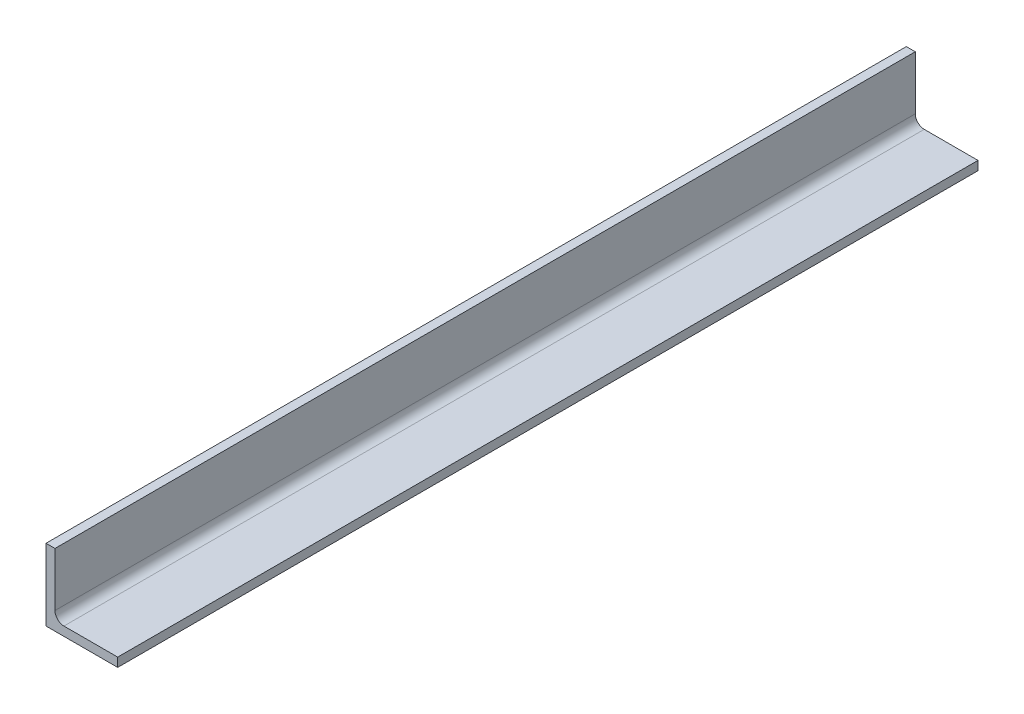
ISO-10303-21;
HEADER;
FILE_DESCRIPTION(('STEP AP214'),'2;1');
FILE_NAME('part.step','',(''),(''),'','','');
FILE_SCHEMA(('AUTOMOTIVE_DESIGN { 1 0 10303 214 1 1 1 1 }'));
ENDSEC;
DATA;
#1=APPLICATION_CONTEXT('core data for automotive mechanical design processes');
#2=APPLICATION_PROTOCOL_DEFINITION('international standard','automotive_design',2000,#1);
#3=PRODUCT_CONTEXT('',#1,'mechanical');
#4=PRODUCT('Part','Part','',(#3));
#5=PRODUCT_RELATED_PRODUCT_CATEGORY('part','',(#4));
#6=PRODUCT_DEFINITION_FORMATION('','',#4);
#7=PRODUCT_DEFINITION_CONTEXT('part definition',#1,'design');
#8=PRODUCT_DEFINITION('design','',#6,#7);
#9=PRODUCT_DEFINITION_SHAPE('','',#8);
#10=(LENGTH_UNIT() NAMED_UNIT(*) SI_UNIT(.MILLI.,.METRE.));
#11=(NAMED_UNIT(*) PLANE_ANGLE_UNIT() SI_UNIT($,.RADIAN.));
#12=(NAMED_UNIT(*) SI_UNIT($,.STERADIAN.) SOLID_ANGLE_UNIT());
#13=UNCERTAINTY_MEASURE_WITH_UNIT(LENGTH_MEASURE(1.E-05),#10,'distance_accuracy_value','');
#14=(GEOMETRIC_REPRESENTATION_CONTEXT(3) GLOBAL_UNCERTAINTY_ASSIGNED_CONTEXT((#13)) GLOBAL_UNIT_ASSIGNED_CONTEXT((#10,
#11,#12)) REPRESENTATION_CONTEXT('',''));
#15=CARTESIAN_POINT('',(0.,0.,0.));
#16=DIRECTION('',(0.,0.,1.));
#17=DIRECTION('',(1.,0.,0.));
#18=AXIS2_PLACEMENT_3D('',#15,#16,#17);
#19=CARTESIAN_POINT('',(50.8,0.,304.8));
#20=DIRECTION('',(0.,1.,0.));
#21=DIRECTION('',(-1.,0.,0.));
#22=AXIS2_PLACEMENT_3D('',#19,#20,#21);
#23=PLANE('',#22);
#24=DIRECTION('',(1.,0.,0.));
#25=VECTOR('',#24,1.);
#26=CARTESIAN_POINT('',(50.8,0.,-304.8));
#27=LINE('',#26,#25);
#28=CARTESIAN_POINT('',(0.,0.,-304.8));
#29=VERTEX_POINT('',#28);
#30=CARTESIAN_POINT('',(50.8,0.,-304.8));
#31=VERTEX_POINT('',#30);
#32=EDGE_CURVE('E125',#29,#31,#27,.T.);
#33=ORIENTED_EDGE('',*,*,#32,.T.);
#34=DIRECTION('',(0.,0.,-1.));
#35=VECTOR('',#34,1.);
#36=CARTESIAN_POINT('',(50.8,0.,304.8));
#37=LINE('',#36,#35);
#38=CARTESIAN_POINT('',(50.8,0.,304.8));
#39=VERTEX_POINT('',#38);
#40=EDGE_CURVE('E11',#39,#31,#37,.T.);
#41=ORIENTED_EDGE('',*,*,#40,.F.);
#42=DIRECTION('',(1.,0.,0.));
#43=VECTOR('',#42,1.);
#44=CARTESIAN_POINT('',(50.8,0.,304.8));
#45=LINE('',#44,#43);
#46=CARTESIAN_POINT('',(0.,0.,304.8));
#47=VERTEX_POINT('',#46);
#48=EDGE_CURVE('E137',#47,#39,#45,.T.);
#49=ORIENTED_EDGE('',*,*,#48,.F.);
#50=DIRECTION('',(0.,0.,-1.));
#51=VECTOR('',#50,1.);
#52=CARTESIAN_POINT('',(0.,0.,304.8));
#53=LINE('',#52,#51);
#54=EDGE_CURVE('E121',#47,#29,#53,.T.);
#55=ORIENTED_EDGE('',*,*,#54,.T.);
#56=EDGE_LOOP('',(#33,#41,#49,#55));
#57=FACE_BOUND('',#56,.T.);
#58=ADVANCED_FACE('F35',(#57),#23,.F.);
#59=CARTESIAN_POINT('',(50.8,6.35000000000001,304.8));
#60=DIRECTION('',(-1.,0.,0.));
#61=DIRECTION('',(0.,0.,1.));
#62=AXIS2_PLACEMENT_3D('',#59,#60,#61);
#63=PLANE('',#62);
#64=DIRECTION('',(0.,1.,0.));
#65=VECTOR('',#64,1.);
#66=CARTESIAN_POINT('',(50.8,6.35000000000001,-304.8));
#67=LINE('',#66,#65);
#68=CARTESIAN_POINT('',(50.8,6.35000000000001,-304.8));
#69=VERTEX_POINT('',#68);
#70=EDGE_CURVE('E128',#31,#69,#67,.T.);
#71=ORIENTED_EDGE('',*,*,#70,.T.);
#72=DIRECTION('',(0.,0.,-1.));
#73=VECTOR('',#72,1.);
#74=CARTESIAN_POINT('',(50.8,6.35000000000001,304.8));
#75=LINE('',#74,#73);
#76=CARTESIAN_POINT('',(50.8,6.35000000000001,304.8));
#77=VERTEX_POINT('',#76);
#78=EDGE_CURVE('E43',#77,#69,#75,.T.);
#79=ORIENTED_EDGE('',*,*,#78,.F.);
#80=DIRECTION('',(0.,1.,0.));
#81=VECTOR('',#80,1.);
#82=CARTESIAN_POINT('',(50.8,6.35000000000001,304.8));
#83=LINE('',#82,#81);
#84=EDGE_CURVE('E91',#39,#77,#83,.T.);
#85=ORIENTED_EDGE('',*,*,#84,.F.);
#86=ORIENTED_EDGE('',*,*,#40,.T.);
#87=EDGE_LOOP('',(#71,#79,#85,#86));
#88=FACE_BOUND('',#87,.T.);
#89=ADVANCED_FACE('F162',(#88),#63,.F.);
#90=CARTESIAN_POINT('',(12.7,6.35000000000001,304.8));
#91=DIRECTION('',(0.,-1.,0.));
#92=DIRECTION('',(0.,0.,-1.));
#93=AXIS2_PLACEMENT_3D('',#90,#91,#92);
#94=PLANE('',#93);
#95=DIRECTION('',(-1.,0.,0.));
#96=VECTOR('',#95,1.);
#97=CARTESIAN_POINT('',(12.7,6.35000000000001,-304.8));
#98=LINE('',#97,#96);
#99=CARTESIAN_POINT('',(12.7,6.35000000000001,-304.8));
#100=VERTEX_POINT('',#99);
#101=EDGE_CURVE('E130',#69,#100,#98,.T.);
#102=ORIENTED_EDGE('',*,*,#101,.T.);
#103=DIRECTION('',(0.,0.,-1.));
#104=VECTOR('',#103,1.);
#105=CARTESIAN_POINT('',(12.7,6.35000000000001,304.8));
#106=LINE('',#105,#104);
#107=CARTESIAN_POINT('',(12.7,6.35000000000001,304.8));
#108=VERTEX_POINT('',#107);
#109=EDGE_CURVE('E141',#108,#100,#106,.T.);
#110=ORIENTED_EDGE('',*,*,#109,.F.);
#111=DIRECTION('',(-1.,0.,0.));
#112=VECTOR('',#111,1.);
#113=CARTESIAN_POINT('',(12.7,6.35000000000001,304.8));
#114=LINE('',#113,#112);
#115=EDGE_CURVE('E149',#77,#108,#114,.T.);
#116=ORIENTED_EDGE('',*,*,#115,.F.);
#117=ORIENTED_EDGE('',*,*,#78,.T.);
#118=EDGE_LOOP('',(#102,#110,#116,#117));
#119=FACE_BOUND('',#118,.T.);
#120=ADVANCED_FACE('F147',(#119),#94,.F.);
#121=CARTESIAN_POINT('',(12.7,12.7,304.8));
#122=DIRECTION('',(0.,0.,-1.));
#123=DIRECTION('',(-1.,0.,0.));
#124=AXIS2_PLACEMENT_3D('',#121,#122,#123);
#125=CYLINDRICAL_SURFACE('',#124,6.35);
#126=CARTESIAN_POINT('',(12.7,12.7,-304.8));
#127=DIRECTION('',(0.,0.,-1.));
#128=DIRECTION('',(-1.,0.,0.));
#129=AXIS2_PLACEMENT_3D('',#126,#127,#128);
#130=CIRCLE('',#129,6.35);
#131=CARTESIAN_POINT('',(6.35,12.7,-304.8));
#132=VERTEX_POINT('',#131);
#133=EDGE_CURVE('E132',#100,#132,#130,.T.);
#134=ORIENTED_EDGE('',*,*,#133,.T.);
#135=DIRECTION('',(0.,0.,-1.));
#136=VECTOR('',#135,1.);
#137=CARTESIAN_POINT('',(6.35,12.7,304.8));
#138=LINE('',#137,#136);
#139=CARTESIAN_POINT('',(6.35,12.7,304.8));
#140=VERTEX_POINT('',#139);
#141=EDGE_CURVE('E116',#140,#132,#138,.T.);
#142=ORIENTED_EDGE('',*,*,#141,.F.);
#143=CARTESIAN_POINT('',(12.7,12.7,304.8));
#144=DIRECTION('',(0.,0.,-1.));
#145=DIRECTION('',(-1.,0.,0.));
#146=AXIS2_PLACEMENT_3D('',#143,#144,#145);
#147=CIRCLE('',#146,6.35);
#148=EDGE_CURVE('E107',#108,#140,#147,.T.);
#149=ORIENTED_EDGE('',*,*,#148,.F.);
#150=ORIENTED_EDGE('',*,*,#109,.T.);
#151=EDGE_LOOP('',(#134,#142,#149,#150));
#152=FACE_BOUND('',#151,.T.);
#153=ADVANCED_FACE('F155',(#152),#125,.F.);
#154=CARTESIAN_POINT('',(6.35,50.8,304.8));
#155=DIRECTION('',(-1.,0.,0.));
#156=DIRECTION('',(0.,-1.,0.));
#157=AXIS2_PLACEMENT_3D('',#154,#155,#156);
#158=PLANE('',#157);
#159=DIRECTION('',(0.,1.,0.));
#160=VECTOR('',#159,1.);
#161=CARTESIAN_POINT('',(6.35,50.8,-304.8));
#162=LINE('',#161,#160);
#163=CARTESIAN_POINT('',(6.35,50.8,-304.8));
#164=VERTEX_POINT('',#163);
#165=EDGE_CURVE('E115',#132,#164,#162,.T.);
#166=ORIENTED_EDGE('',*,*,#165,.T.);
#167=DIRECTION('',(0.,0.,-1.));
#168=VECTOR('',#167,1.);
#169=CARTESIAN_POINT('',(6.35,50.8,304.8));
#170=LINE('',#169,#168);
#171=CARTESIAN_POINT('',(6.35,50.8,304.8));
#172=VERTEX_POINT('',#171);
#173=EDGE_CURVE('E112',#172,#164,#170,.T.);
#174=ORIENTED_EDGE('',*,*,#173,.F.);
#175=DIRECTION('',(0.,1.,0.));
#176=VECTOR('',#175,1.);
#177=CARTESIAN_POINT('',(6.35,50.8,304.8));
#178=LINE('',#177,#176);
#179=EDGE_CURVE('E101',#140,#172,#178,.T.);
#180=ORIENTED_EDGE('',*,*,#179,.F.);
#181=ORIENTED_EDGE('',*,*,#141,.T.);
#182=EDGE_LOOP('',(#166,#174,#180,#181));
#183=FACE_BOUND('',#182,.T.);
#184=ADVANCED_FACE('F113',(#183),#158,.F.);
#185=CARTESIAN_POINT('',(0.,50.8,304.8));
#186=DIRECTION('',(0.,-1.,0.));
#187=DIRECTION('',(0.,0.,-1.));
#188=AXIS2_PLACEMENT_3D('',#185,#186,#187);
#189=PLANE('',#188);
#190=DIRECTION('',(-1.,0.,0.));
#191=VECTOR('',#190,1.);
#192=CARTESIAN_POINT('',(0.,50.8,-304.8));
#193=LINE('',#192,#191);
#194=CARTESIAN_POINT('',(0.,50.8,-304.8));
#195=VERTEX_POINT('',#194);
#196=EDGE_CURVE('E77',#164,#195,#193,.T.);
#197=ORIENTED_EDGE('',*,*,#196,.T.);
#198=DIRECTION('',(0.,0.,-1.));
#199=VECTOR('',#198,1.);
#200=CARTESIAN_POINT('',(0.,50.8,304.8));
#201=LINE('',#200,#199);
#202=CARTESIAN_POINT('',(0.,50.8,304.8));
#203=VERTEX_POINT('',#202);
#204=EDGE_CURVE('E117',#203,#195,#201,.T.);
#205=ORIENTED_EDGE('',*,*,#204,.F.);
#206=DIRECTION('',(-1.,0.,0.));
#207=VECTOR('',#206,1.);
#208=CARTESIAN_POINT('',(0.,50.8,304.8));
#209=LINE('',#208,#207);
#210=EDGE_CURVE('E105',#172,#203,#209,.T.);
#211=ORIENTED_EDGE('',*,*,#210,.F.);
#212=ORIENTED_EDGE('',*,*,#173,.T.);
#213=EDGE_LOOP('',(#197,#205,#211,#212));
#214=FACE_BOUND('',#213,.T.);
#215=ADVANCED_FACE('F119',(#214),#189,.F.);
#216=CARTESIAN_POINT('',(0.,0.,304.8));
#217=DIRECTION('',(1.,0.,0.));
#218=DIRECTION('',(0.,0.,-1.));
#219=AXIS2_PLACEMENT_3D('',#216,#217,#218);
#220=PLANE('',#219);
#221=DIRECTION('',(0.,-1.,0.));
#222=VECTOR('',#221,1.);
#223=CARTESIAN_POINT('',(0.,0.,-304.8));
#224=LINE('',#223,#222);
#225=EDGE_CURVE('E83',#195,#29,#224,.T.);
#226=ORIENTED_EDGE('',*,*,#225,.T.);
#227=ORIENTED_EDGE('',*,*,#54,.F.);
#228=DIRECTION('',(0.,-1.,0.));
#229=VECTOR('',#228,1.);
#230=CARTESIAN_POINT('',(0.,0.,304.8));
#231=LINE('',#230,#229);
#232=EDGE_CURVE('E51',#203,#47,#231,.T.);
#233=ORIENTED_EDGE('',*,*,#232,.F.);
#234=ORIENTED_EDGE('',*,*,#204,.T.);
#235=EDGE_LOOP('',(#226,#227,#233,#234));
#236=FACE_BOUND('',#235,.T.);
#237=ADVANCED_FACE('F176',(#236),#220,.F.);
#238=CARTESIAN_POINT('',(12.7,12.7,304.8));
#239=DIRECTION('',(0.,0.,-1.));
#240=DIRECTION('',(-1.,0.,0.));
#241=AXIS2_PLACEMENT_3D('',#238,#239,#240);
#242=PLANE('',#241);
#243=ORIENTED_EDGE('',*,*,#48,.T.);
#244=ORIENTED_EDGE('',*,*,#84,.T.);
#245=ORIENTED_EDGE('',*,*,#115,.T.);
#246=ORIENTED_EDGE('',*,*,#148,.T.);
#247=ORIENTED_EDGE('',*,*,#179,.T.);
#248=ORIENTED_EDGE('',*,*,#210,.T.);
#249=ORIENTED_EDGE('',*,*,#232,.T.);
#250=EDGE_LOOP('',(#243,#244,#245,#246,#247,#248,#249));
#251=FACE_BOUND('',#250,.T.);
#252=ADVANCED_FACE('F103',(#251),#242,.F.);
#253=CARTESIAN_POINT('',(12.7,12.7,-304.8));
#254=DIRECTION('',(0.,0.,-1.));
#255=DIRECTION('',(-1.,0.,0.));
#256=AXIS2_PLACEMENT_3D('',#253,#254,#255);
#257=PLANE('',#256);
#258=ORIENTED_EDGE('',*,*,#32,.F.);
#259=ORIENTED_EDGE('',*,*,#225,.F.);
#260=ORIENTED_EDGE('',*,*,#196,.F.);
#261=ORIENTED_EDGE('',*,*,#165,.F.);
#262=ORIENTED_EDGE('',*,*,#133,.F.);
#263=ORIENTED_EDGE('',*,*,#101,.F.);
#264=ORIENTED_EDGE('',*,*,#70,.F.);
#265=EDGE_LOOP('',(#258,#259,#260,#261,#262,#263,#264));
#266=FACE_BOUND('',#265,.T.);
#267=ADVANCED_FACE('F153',(#266),#257,.T.);
#268=CLOSED_SHELL('',(#58,#89,#120,#153,#184,#215,#237,#252,#267));
#269=MANIFOLD_SOLID_BREP('B2',#268);
#270=ADVANCED_BREP_SHAPE_REPRESENTATION('',(#18,#269),#14);
#271=SHAPE_DEFINITION_REPRESENTATION(#9,#270);
ENDSEC;
END-ISO-10303-21;
